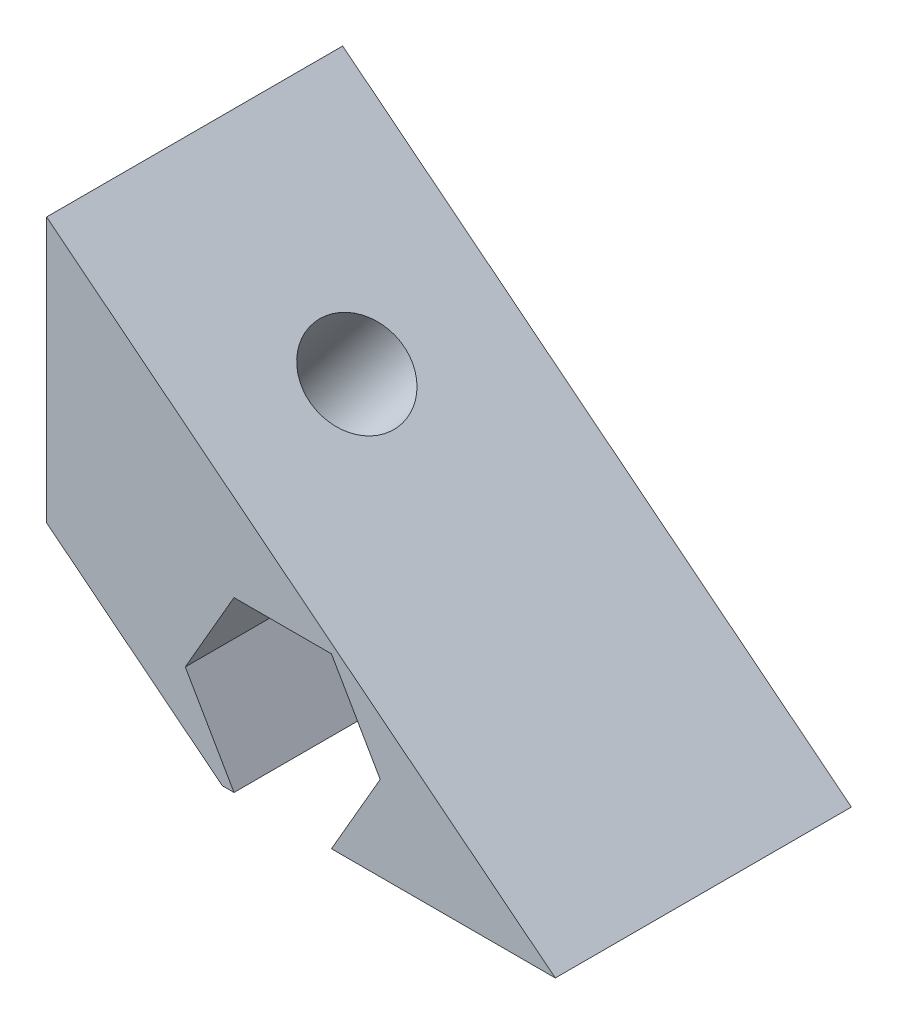
ISO-10303-21;
HEADER;
FILE_DESCRIPTION(('STEP AP214'),'2;1');
FILE_NAME('part.step','',(''),(''),'','','');
FILE_SCHEMA(('AUTOMOTIVE_DESIGN { 1 0 10303 214 1 1 1 1 }'));
ENDSEC;
DATA;
#1=APPLICATION_CONTEXT('core data for automotive mechanical design processes');
#2=APPLICATION_PROTOCOL_DEFINITION('international standard','automotive_design',2000,#1);
#3=PRODUCT_CONTEXT('',#1,'mechanical');
#4=PRODUCT('Part','Part','',(#3));
#5=PRODUCT_RELATED_PRODUCT_CATEGORY('part','',(#4));
#6=PRODUCT_DEFINITION_FORMATION('','',#4);
#7=PRODUCT_DEFINITION_CONTEXT('part definition',#1,'design');
#8=PRODUCT_DEFINITION('design','',#6,#7);
#9=PRODUCT_DEFINITION_SHAPE('','',#8);
#10=(LENGTH_UNIT() NAMED_UNIT(*) SI_UNIT(.MILLI.,.METRE.));
#11=(NAMED_UNIT(*) PLANE_ANGLE_UNIT() SI_UNIT($,.RADIAN.));
#12=(NAMED_UNIT(*) SI_UNIT($,.STERADIAN.) SOLID_ANGLE_UNIT());
#13=UNCERTAINTY_MEASURE_WITH_UNIT(LENGTH_MEASURE(1.E-05),#10,'distance_accuracy_value','');
#14=(GEOMETRIC_REPRESENTATION_CONTEXT(3) GLOBAL_UNCERTAINTY_ASSIGNED_CONTEXT((#13)) GLOBAL_UNIT_ASSIGNED_CONTEXT((#10,
#11,#12)) REPRESENTATION_CONTEXT('',''));
#15=CARTESIAN_POINT('',(0.,0.,0.));
#16=DIRECTION('',(0.,0.,1.));
#17=DIRECTION('',(1.,0.,0.));
#18=AXIS2_PLACEMENT_3D('',#15,#16,#17);
#19=CARTESIAN_POINT('',(-1.18087962656431,0.937540612039793,5.));
#20=DIRECTION('',(0.622523565821539,0.782601054175649,0.));
#21=DIRECTION('',(-0.782601054175649,0.622523565821539,0.));
#22=AXIS2_PLACEMENT_3D('',#19,#20,#21);
#23=CYLINDRICAL_SURFACE('',#22,1.6);
#24=CARTESIAN_POINT('',(5.47820737922954,9.30896427646635,5.));
#25=DIRECTION('',(0.622523565821539,0.782601054175649,0.));
#26=DIRECTION('',(-0.782601054175649,0.622523565821539,0.));
#27=AXIS2_PLACEMENT_3D('',#24,#25,#26);
#28=CIRCLE('',#27,1.6);
#29=CARTESIAN_POINT('',(4.2260456925485,10.3050019817808,5.));
#30=VERTEX_POINT('',#29);
#31=EDGE_CURVE('E209',#30,#30,#28,.T.);
#32=ORIENTED_EDGE('',*,*,#31,.T.);
#33=EDGE_LOOP('',(#32));
#34=FACE_BOUND('',#33,.T.);
#35=CARTESIAN_POINT('',(2.67685133303261,5.78725953267592,5.));
#36=DIRECTION('',(-0.622523565821539,-0.782601054175649,0.));
#37=DIRECTION('',(0.782601054175649,-0.622523565821539,0.));
#38=AXIS2_PLACEMENT_3D('',#35,#36,#37);
#39=CIRCLE('',#38,1.6);
#40=CARTESIAN_POINT('',(3.92901301971365,4.79122182736146,5.));
#41=VERTEX_POINT('',#40);
#42=EDGE_CURVE('E201',#41,#41,#39,.F.);
#43=ORIENTED_EDGE('',*,*,#42,.F.);
#44=EDGE_LOOP('',(#43));
#45=FACE_BOUND('',#44,.T.);
#46=ADVANCED_FACE('F32',(#34,#45),#23,.F.);
#47=CARTESIAN_POINT('',(7.97577106518184,2.85,10.));
#48=DIRECTION('',(0.,0.,-1.));
#49=DIRECTION('',(-1.,0.,0.));
#50=AXIS2_PLACEMENT_3D('',#47,#48,#49);
#51=CYLINDRICAL_SURFACE('',#50,1.6);
#52=CARTESIAN_POINT('',(7.97577106518184,2.85,0.));
#53=DIRECTION('',(0.,0.,1.));
#54=DIRECTION('',(1.,0.,0.));
#55=AXIS2_PLACEMENT_3D('',#52,#53,#54);
#56=CIRCLE('',#55,1.6);
#57=CARTESIAN_POINT('',(9.57577106518184,2.85,0.));
#58=VERTEX_POINT('',#57);
#59=EDGE_CURVE('E253',#58,#58,#56,.T.);
#60=ORIENTED_EDGE('',*,*,#59,.F.);
#61=EDGE_LOOP('',(#60));
#62=FACE_BOUND('',#61,.T.);
#63=CARTESIAN_POINT('',(7.97577106518184,2.85,4.5));
#64=DIRECTION('',(0.,0.,1.));
#65=DIRECTION('',(1.,0.,0.));
#66=AXIS2_PLACEMENT_3D('',#63,#64,#65);
#67=CIRCLE('',#66,1.6);
#68=CARTESIAN_POINT('',(9.57577106518184,2.85,4.5));
#69=VERTEX_POINT('',#68);
#70=EDGE_CURVE('E252',#69,#69,#67,.T.);
#71=ORIENTED_EDGE('',*,*,#70,.T.);
#72=EDGE_LOOP('',(#71));
#73=FACE_BOUND('',#72,.T.);
#74=ADVANCED_FACE('F379',(#62,#73),#51,.F.);
#75=CARTESIAN_POINT('',(0.,13.6666292372171,10.));
#76=DIRECTION('',(0.,0.,1.));
#77=DIRECTION('',(1.,0.,0.));
#78=AXIS2_PLACEMENT_3D('',#75,#76,#77);
#79=PLANE('',#78);
#80=DIRECTION('',(0.500000000000001,-0.866025403784438,0.));
#81=VECTOR('',#80,1.);
#82=CARTESIAN_POINT('',(4.68487453080097,2.85,10.));
#83=LINE('',#82,#81);
#84=CARTESIAN_POINT('',(4.68487453080097,2.85,10.));
#85=VERTEX_POINT('',#84);
#86=CARTESIAN_POINT('',(6.33032279799141,0.,10.));
#87=VERTEX_POINT('',#86);
#88=EDGE_CURVE('E212',#85,#87,#83,.T.);
#89=ORIENTED_EDGE('',*,*,#88,.F.);
#90=DIRECTION('',(-0.5,-0.866025403784438,0.));
#91=VECTOR('',#90,1.);
#92=CARTESIAN_POINT('',(6.33032279799141,5.7,10.));
#93=LINE('',#92,#91);
#94=CARTESIAN_POINT('',(6.33032279799141,5.7,10.));
#95=VERTEX_POINT('',#94);
#96=EDGE_CURVE('E235',#95,#85,#93,.T.);
#97=ORIENTED_EDGE('',*,*,#96,.F.);
#98=DIRECTION('',(-1.,0.,0.));
#99=VECTOR('',#98,1.);
#100=CARTESIAN_POINT('',(9.62121933237227,5.7,10.));
#101=LINE('',#100,#99);
#102=CARTESIAN_POINT('',(9.62121933237227,5.7,10.));
#103=VERTEX_POINT('',#102);
#104=EDGE_CURVE('E232',#103,#95,#101,.T.);
#105=ORIENTED_EDGE('',*,*,#104,.F.);
#106=DIRECTION('',(-0.5,0.866025403784439,0.));
#107=VECTOR('',#106,1.);
#108=CARTESIAN_POINT('',(11.2666675995627,2.85,10.));
#109=LINE('',#108,#107);
#110=CARTESIAN_POINT('',(11.2666675995627,2.85,10.));
#111=VERTEX_POINT('',#110);
#112=EDGE_CURVE('E229',#111,#103,#109,.T.);
#113=ORIENTED_EDGE('',*,*,#112,.F.);
#114=DIRECTION('',(0.5,0.866025403784439,0.));
#115=VECTOR('',#114,1.);
#116=CARTESIAN_POINT('',(9.62121933237227,0.,10.));
#117=LINE('',#116,#115);
#118=CARTESIAN_POINT('',(9.62121933237227,0.,10.));
#119=VERTEX_POINT('',#118);
#120=EDGE_CURVE('E226',#119,#111,#117,.T.);
#121=ORIENTED_EDGE('',*,*,#120,.F.);
#122=DIRECTION('',(1.,0.,0.));
#123=VECTOR('',#122,1.);
#124=CARTESIAN_POINT('',(17.1809053267872,0.,10.));
#125=LINE('',#124,#123);
#126=CARTESIAN_POINT('',(17.1809053267872,0.,10.));
#127=VERTEX_POINT('',#126);
#128=EDGE_CURVE('E265',#119,#127,#125,.T.);
#129=ORIENTED_EDGE('',*,*,#128,.T.);
#130=DIRECTION('',(-0.782601054175649,0.622523565821539,0.));
#131=VECTOR('',#130,1.);
#132=CARTESIAN_POINT('',(0.,13.6666292372171,10.));
#133=LINE('',#132,#131);
#134=CARTESIAN_POINT('',(0.,13.6666292372171,10.));
#135=VERTEX_POINT('',#134);
#136=EDGE_CURVE('E257',#127,#135,#133,.T.);
#137=ORIENTED_EDGE('',*,*,#136,.T.);
#138=DIRECTION('',(0.,-1.,0.));
#139=VECTOR('',#138,1.);
#140=CARTESIAN_POINT('',(0.,4.72209745739037,10.));
#141=LINE('',#140,#139);
#142=CARTESIAN_POINT('',(0.,4.72209745739037,10.));
#143=VERTEX_POINT('',#142);
#144=EDGE_CURVE('E260',#135,#143,#141,.T.);
#145=ORIENTED_EDGE('',*,*,#144,.T.);
#146=DIRECTION('',(0.782601054175649,-0.622523565821538,0.));
#147=VECTOR('',#146,1.);
#148=CARTESIAN_POINT('',(5.93635108929075,0.,10.));
#149=LINE('',#148,#147);
#150=CARTESIAN_POINT('',(5.93635108929075,0.,10.));
#151=VERTEX_POINT('',#150);
#152=EDGE_CURVE('E263',#143,#151,#149,.T.);
#153=ORIENTED_EDGE('',*,*,#152,.T.);
#154=EDGE_CURVE('E266',#151,#87,#125,.T.);
#155=ORIENTED_EDGE('',*,*,#154,.T.);
#156=EDGE_LOOP('',(#89,#97,#105,#113,#121,#129,#137,#145,#153,#155));
#157=FACE_BOUND('',#156,.T.);
#158=ADVANCED_FACE('F338',(#157),#79,.T.);
#159=CARTESIAN_POINT('',(0.,13.6666292372171,0.));
#160=DIRECTION('',(0.,0.,1.));
#161=DIRECTION('',(1.,0.,0.));
#162=AXIS2_PLACEMENT_3D('',#159,#160,#161);
#163=PLANE('',#162);
#164=DIRECTION('',(-0.782601054175649,0.622523565821539,0.));
#165=VECTOR('',#164,1.);
#166=CARTESIAN_POINT('',(0.,13.6666292372171,0.));
#167=LINE('',#166,#165);
#168=CARTESIAN_POINT('',(17.1809053267872,0.,0.));
#169=VERTEX_POINT('',#168);
#170=CARTESIAN_POINT('',(0.,13.6666292372171,0.));
#171=VERTEX_POINT('',#170);
#172=EDGE_CURVE('E256',#169,#171,#167,.T.);
#173=ORIENTED_EDGE('',*,*,#172,.F.);
#174=DIRECTION('',(1.,0.,0.));
#175=VECTOR('',#174,1.);
#176=CARTESIAN_POINT('',(17.1809053267872,0.,0.));
#177=LINE('',#176,#175);
#178=CARTESIAN_POINT('',(5.93635108929075,0.,0.));
#179=VERTEX_POINT('',#178);
#180=EDGE_CURVE('E261',#179,#169,#177,.T.);
#181=ORIENTED_EDGE('',*,*,#180,.F.);
#182=DIRECTION('',(0.782601054175649,-0.622523565821538,0.));
#183=VECTOR('',#182,1.);
#184=CARTESIAN_POINT('',(5.93635108929075,0.,0.));
#185=LINE('',#184,#183);
#186=CARTESIAN_POINT('',(0.,4.72209745739037,0.));
#187=VERTEX_POINT('',#186);
#188=EDGE_CURVE('E275',#187,#179,#185,.T.);
#189=ORIENTED_EDGE('',*,*,#188,.F.);
#190=DIRECTION('',(0.,-1.,0.));
#191=VECTOR('',#190,1.);
#192=CARTESIAN_POINT('',(0.,4.72209745739037,0.));
#193=LINE('',#192,#191);
#194=EDGE_CURVE('E272',#171,#187,#193,.T.);
#195=ORIENTED_EDGE('',*,*,#194,.F.);
#196=EDGE_LOOP('',(#173,#181,#189,#195));
#197=FACE_BOUND('',#196,.T.);
#198=ORIENTED_EDGE('',*,*,#59,.T.);
#199=EDGE_LOOP('',(#198));
#200=FACE_BOUND('',#199,.T.);
#201=ADVANCED_FACE('F329',(#197,#200),#163,.F.);
#202=CARTESIAN_POINT('',(0.,13.6666292372171,10.));
#203=DIRECTION('',(-0.622523565821539,-0.782601054175649,0.));
#204=DIRECTION('',(0.782601054175649,-0.622523565821539,0.));
#205=AXIS2_PLACEMENT_3D('',#202,#203,#204);
#206=PLANE('',#205);
#207=ORIENTED_EDGE('',*,*,#31,.F.);
#208=EDGE_LOOP('',(#207));
#209=FACE_BOUND('',#208,.T.);
#210=ORIENTED_EDGE('',*,*,#172,.T.);
#211=DIRECTION('',(0.,0.,-1.));
#212=VECTOR('',#211,1.);
#213=CARTESIAN_POINT('',(0.,13.6666292372171,10.));
#214=LINE('',#213,#212);
#215=EDGE_CURVE('E285',#135,#171,#214,.T.);
#216=ORIENTED_EDGE('',*,*,#215,.F.);
#217=ORIENTED_EDGE('',*,*,#136,.F.);
#218=DIRECTION('',(0.,0.,-1.));
#219=VECTOR('',#218,1.);
#220=CARTESIAN_POINT('',(17.1809053267872,0.,10.));
#221=LINE('',#220,#219);
#222=EDGE_CURVE('E269',#127,#169,#221,.T.);
#223=ORIENTED_EDGE('',*,*,#222,.T.);
#224=EDGE_LOOP('',(#210,#216,#217,#223));
#225=FACE_BOUND('',#224,.T.);
#226=ADVANCED_FACE('F34',(#209,#225),#206,.F.);
#227=CARTESIAN_POINT('',(0.,4.72209745739037,10.));
#228=DIRECTION('',(1.,0.,0.));
#229=DIRECTION('',(0.,1.,0.));
#230=AXIS2_PLACEMENT_3D('',#227,#228,#229);
#231=PLANE('',#230);
#232=DIRECTION('',(0.,0.,-1.));
#233=VECTOR('',#232,1.);
#234=CARTESIAN_POINT('',(0.,4.72209745739037,10.));
#235=LINE('',#234,#233);
#236=CARTESIAN_POINT('',(0.,4.72209745739037,2.15));
#237=VERTEX_POINT('',#236);
#238=EDGE_CURVE('E283',#237,#187,#235,.T.);
#239=ORIENTED_EDGE('',*,*,#238,.F.);
#240=DIRECTION('',(0.,1.,0.));
#241=VECTOR('',#240,1.);
#242=CARTESIAN_POINT('',(0.,4.72209745739037,2.15));
#243=LINE('',#242,#241);
#244=CARTESIAN_POINT('',(0.,5.06526532620885,2.15));
#245=VERTEX_POINT('',#244);
#246=EDGE_CURVE('E206',#237,#245,#243,.T.);
#247=ORIENTED_EDGE('',*,*,#246,.T.);
#248=DIRECTION('',(0.,0.680003614075,0.733208759389124));
#249=VECTOR('',#248,1.);
#250=CARTESIAN_POINT('',(0.,8.8204719760539,6.19902319927818));
#251=LINE('',#250,#249);
#252=CARTESIAN_POINT('',(0.,7.70845565269705,5.));
#253=VERTEX_POINT('',#252);
#254=EDGE_CURVE('E12',#245,#253,#251,.T.);
#255=ORIENTED_EDGE('',*,*,#254,.T.);
#256=DIRECTION('',(0.,-0.680003614074999,0.733208759389125));
#257=VECTOR('',#256,1.);
#258=CARTESIAN_POINT('',(0.,3.83462591349338,9.17692764917121));
#259=LINE('',#258,#257);
#260=CARTESIAN_POINT('',(0.,5.06526532620885,7.85));
#261=VERTEX_POINT('',#260);
#262=EDGE_CURVE('E40',#253,#261,#259,.T.);
#263=ORIENTED_EDGE('',*,*,#262,.T.);
#264=DIRECTION('',(0.,-1.,0.));
#265=VECTOR('',#264,1.);
#266=CARTESIAN_POINT('',(0.,4.72209745739037,7.85));
#267=LINE('',#266,#265);
#268=CARTESIAN_POINT('',(0.,4.72209745739037,7.85));
#269=VERTEX_POINT('',#268);
#270=EDGE_CURVE('E204',#261,#269,#267,.T.);
#271=ORIENTED_EDGE('',*,*,#270,.T.);
#272=EDGE_CURVE('E182',#143,#269,#235,.T.);
#273=ORIENTED_EDGE('',*,*,#272,.F.);
#274=ORIENTED_EDGE('',*,*,#144,.F.);
#275=ORIENTED_EDGE('',*,*,#215,.T.);
#276=ORIENTED_EDGE('',*,*,#194,.T.);
#277=EDGE_LOOP('',(#239,#247,#255,#263,#271,#273,#274,#275,#276));
#278=FACE_BOUND('',#277,.T.);
#279=ADVANCED_FACE('F300',(#278),#231,.F.);
#280=CARTESIAN_POINT('',(5.93635108929075,0.,10.));
#281=DIRECTION('',(0.622523565821538,0.782601054175649,0.));
#282=DIRECTION('',(-0.782601054175649,0.622523565821538,0.));
#283=AXIS2_PLACEMENT_3D('',#280,#281,#282);
#284=PLANE('',#283);
#285=DIRECTION('',(0.391300527087824,-0.311261782910769,0.866025403784439));
#286=VECTOR('',#285,1.);
#287=CARTESIAN_POINT('',(2.40827196697349,2.80642657457054,2.15));
#288=LINE('',#287,#286);
#289=CARTESIAN_POINT('',(2.40827196697349,2.80642657457054,2.15));
#290=VERTEX_POINT('',#289);
#291=CARTESIAN_POINT('',(3.69600151546822,1.78209625190428,5.));
#292=VERTEX_POINT('',#291);
#293=EDGE_CURVE('E47',#290,#292,#288,.T.);
#294=ORIENTED_EDGE('',*,*,#293,.F.);
#295=DIRECTION('',(0.782601054175649,-0.622523565821539,0.));
#296=VECTOR('',#295,1.);
#297=CARTESIAN_POINT('',(-0.167187130015962,4.85508721990307,2.15));
#298=LINE('',#297,#296);
#299=EDGE_CURVE('E183',#237,#290,#298,.T.);
#300=ORIENTED_EDGE('',*,*,#299,.F.);
#301=ORIENTED_EDGE('',*,*,#238,.T.);
#302=ORIENTED_EDGE('',*,*,#188,.T.);
#303=DIRECTION('',(0.,0.,-1.));
#304=VECTOR('',#303,1.);
#305=CARTESIAN_POINT('',(5.93635108929075,0.,10.));
#306=LINE('',#305,#304);
#307=EDGE_CURVE('E280',#151,#179,#306,.T.);
#308=ORIENTED_EDGE('',*,*,#307,.F.);
#309=ORIENTED_EDGE('',*,*,#152,.F.);
#310=ORIENTED_EDGE('',*,*,#272,.T.);
#311=DIRECTION('',(-0.782601054175649,0.622523565821539,0.));
#312=VECTOR('',#311,1.);
#313=CARTESIAN_POINT('',(2.40827196697349,2.80642657457055,7.85));
#314=LINE('',#313,#312);
#315=CARTESIAN_POINT('',(2.40827196697349,2.80642657457055,7.85));
#316=VERTEX_POINT('',#315);
#317=EDGE_CURVE('E163',#316,#269,#314,.T.);
#318=ORIENTED_EDGE('',*,*,#317,.F.);
#319=DIRECTION('',(-0.391300527087825,0.311261782910769,0.866025403784438));
#320=VECTOR('',#319,1.);
#321=CARTESIAN_POINT('',(3.69600151546822,1.78209625190428,5.));
#322=LINE('',#321,#320);
#323=EDGE_CURVE('E174',#292,#316,#322,.T.);
#324=ORIENTED_EDGE('',*,*,#323,.F.);
#325=EDGE_LOOP('',(#294,#300,#301,#302,#308,#309,#310,#318,#324));
#326=FACE_BOUND('',#325,.T.);
#327=ADVANCED_FACE('F179',(#326),#284,.F.);
#328=CARTESIAN_POINT('',(17.1809053267872,0.,10.));
#329=DIRECTION('',(0.,1.,0.));
#330=DIRECTION('',(-1.,0.,0.));
#331=AXIS2_PLACEMENT_3D('',#328,#329,#330);
#332=PLANE('',#331);
#333=DIRECTION('',(-1.,0.,0.));
#334=VECTOR('',#333,1.);
#335=CARTESIAN_POINT('',(6.33032279799141,0.,4.5));
#336=LINE('',#335,#334);
#337=CARTESIAN_POINT('',(9.62121933237227,0.,4.5));
#338=VERTEX_POINT('',#337);
#339=CARTESIAN_POINT('',(6.33032279799141,0.,4.5));
#340=VERTEX_POINT('',#339);
#341=EDGE_CURVE('E224',#338,#340,#336,.T.);
#342=ORIENTED_EDGE('',*,*,#341,.T.);
#343=DIRECTION('',(0.,0.,1.));
#344=VECTOR('',#343,1.);
#345=CARTESIAN_POINT('',(6.33032279799141,0.,-8.70689382041609));
#346=LINE('',#345,#344);
#347=EDGE_CURVE('E238',#340,#87,#346,.T.);
#348=ORIENTED_EDGE('',*,*,#347,.T.);
#349=ORIENTED_EDGE('',*,*,#154,.F.);
#350=ORIENTED_EDGE('',*,*,#307,.T.);
#351=ORIENTED_EDGE('',*,*,#180,.T.);
#352=ORIENTED_EDGE('',*,*,#222,.F.);
#353=ORIENTED_EDGE('',*,*,#128,.F.);
#354=DIRECTION('',(0.,0.,1.));
#355=VECTOR('',#354,1.);
#356=CARTESIAN_POINT('',(9.62121933237227,0.,-8.70689382041609));
#357=LINE('',#356,#355);
#358=EDGE_CURVE('E246',#338,#119,#357,.T.);
#359=ORIENTED_EDGE('',*,*,#358,.F.);
#360=EDGE_LOOP('',(#342,#348,#349,#350,#351,#352,#353,#359));
#361=FACE_BOUND('',#360,.T.);
#362=ADVANCED_FACE('F334',(#361),#332,.F.);
#363=CARTESIAN_POINT('',(4.68487453080097,2.85,-8.70689382041609));
#364=DIRECTION('',(-0.866025403784438,-0.500000000000001,0.));
#365=DIRECTION('',(0.500000000000001,-0.866025403784438,0.));
#366=AXIS2_PLACEMENT_3D('',#363,#364,#365);
#367=PLANE('',#366);
#368=DIRECTION('',(-0.500000000000001,0.866025403784438,0.));
#369=VECTOR('',#368,1.);
#370=CARTESIAN_POINT('',(4.68487453080097,2.85,4.5));
#371=LINE('',#370,#369);
#372=CARTESIAN_POINT('',(4.68487453080097,2.85,4.5));
#373=VERTEX_POINT('',#372);
#374=EDGE_CURVE('E222',#340,#373,#371,.T.);
#375=ORIENTED_EDGE('',*,*,#374,.T.);
#376=DIRECTION('',(0.,0.,1.));
#377=VECTOR('',#376,1.);
#378=CARTESIAN_POINT('',(4.68487453080097,2.85,-8.70689382041609));
#379=LINE('',#378,#377);
#380=EDGE_CURVE('E216',#373,#85,#379,.T.);
#381=ORIENTED_EDGE('',*,*,#380,.T.);
#382=ORIENTED_EDGE('',*,*,#88,.T.);
#383=ORIENTED_EDGE('',*,*,#347,.F.);
#384=EDGE_LOOP('',(#375,#381,#382,#383));
#385=FACE_BOUND('',#384,.T.);
#386=ADVANCED_FACE('F363',(#385),#367,.F.);
#387=CARTESIAN_POINT('',(6.33032279799141,5.7,-8.70689382041609));
#388=DIRECTION('',(-0.866025403784438,0.5,0.));
#389=DIRECTION('',(-0.5,-0.866025403784438,0.));
#390=AXIS2_PLACEMENT_3D('',#387,#388,#389);
#391=PLANE('',#390);
#392=DIRECTION('',(0.,0.,1.));
#393=VECTOR('',#392,1.);
#394=CARTESIAN_POINT('',(5.21502903711291,3.76825454079387,-8.70689382041609));
#395=LINE('',#394,#393);
#396=CARTESIAN_POINT('',(5.21502903711291,3.76825454079387,4.91748890913058));
#397=VERTEX_POINT('',#396);
#398=CARTESIAN_POINT('',(5.21502903711291,3.76825454079387,5.08251109086943));
#399=VERTEX_POINT('',#398);
#400=EDGE_CURVE('E202',#397,#399,#395,.T.);
#401=ORIENTED_EDGE('',*,*,#400,.F.);
#402=DIRECTION('',(-0.484375872290359,-0.838963620767395,0.248032371620754));
#403=VECTOR('',#402,1.);
#404=CARTESIAN_POINT('',(7.89855541531584,8.41625857129264,3.54334653340644));
#405=LINE('',#404,#403);
#406=CARTESIAN_POINT('',(5.05389530544575,3.48916273073317,5.));
#407=VERTEX_POINT('',#406);
#408=EDGE_CURVE('E295',#397,#407,#405,.T.);
#409=ORIENTED_EDGE('',*,*,#408,.T.);
#410=DIRECTION('',(0.484375872290359,0.838963620767395,0.248032371620754));
#411=VECTOR('',#410,1.);
#412=CARTESIAN_POINT('',(4.60503839552223,2.71171975741727,4.7701556781508));
#413=LINE('',#412,#411);
#414=EDGE_CURVE('E288',#407,#399,#413,.T.);
#415=ORIENTED_EDGE('',*,*,#414,.T.);
#416=EDGE_LOOP('',(#401,#409,#415));
#417=FACE_BOUND('',#416,.T.);
#418=DIRECTION('',(0.5,0.866025403784439,0.));
#419=VECTOR('',#418,1.);
#420=CARTESIAN_POINT('',(6.33032279799141,5.7,4.5));
#421=LINE('',#420,#419);
#422=CARTESIAN_POINT('',(6.33032279799141,5.7,4.5));
#423=VERTEX_POINT('',#422);
#424=EDGE_CURVE('E220',#373,#423,#421,.T.);
#425=ORIENTED_EDGE('',*,*,#424,.T.);
#426=DIRECTION('',(0.,0.,1.));
#427=VECTOR('',#426,1.);
#428=CARTESIAN_POINT('',(6.33032279799141,5.7,-8.70689382041609));
#429=LINE('',#428,#427);
#430=EDGE_CURVE('E240',#423,#95,#429,.T.);
#431=ORIENTED_EDGE('',*,*,#430,.T.);
#432=ORIENTED_EDGE('',*,*,#96,.T.);
#433=ORIENTED_EDGE('',*,*,#380,.F.);
#434=EDGE_LOOP('',(#425,#431,#432,#433));
#435=FACE_BOUND('',#434,.T.);
#436=ADVANCED_FACE('F365',(#417,#435),#391,.F.);
#437=CARTESIAN_POINT('',(9.62121933237227,5.7,-8.70689382041609));
#438=DIRECTION('',(0.,1.,0.));
#439=DIRECTION('',(0.,0.,1.));
#440=AXIS2_PLACEMENT_3D('',#437,#438,#439);
#441=PLANE('',#440);
#442=DIRECTION('',(1.,0.,0.));
#443=VECTOR('',#442,1.);
#444=CARTESIAN_POINT('',(9.62121933237227,5.7,4.5));
#445=LINE('',#444,#443);
#446=CARTESIAN_POINT('',(9.62121933237227,5.7,4.5));
#447=VERTEX_POINT('',#446);
#448=EDGE_CURVE('E218',#423,#447,#445,.T.);
#449=ORIENTED_EDGE('',*,*,#448,.T.);
#450=DIRECTION('',(0.,0.,1.));
#451=VECTOR('',#450,1.);
#452=CARTESIAN_POINT('',(9.62121933237227,5.7,-8.70689382041609));
#453=LINE('',#452,#451);
#454=EDGE_CURVE('E242',#447,#103,#453,.T.);
#455=ORIENTED_EDGE('',*,*,#454,.T.);
#456=ORIENTED_EDGE('',*,*,#104,.T.);
#457=ORIENTED_EDGE('',*,*,#430,.F.);
#458=EDGE_LOOP('',(#449,#455,#456,#457));
#459=FACE_BOUND('',#458,.T.);
#460=ADVANCED_FACE('F368',(#459),#441,.F.);
#461=CARTESIAN_POINT('',(11.2666675995627,2.85,-8.70689382041609));
#462=DIRECTION('',(0.866025403784438,0.5,0.));
#463=DIRECTION('',(-0.5,0.866025403784439,0.));
#464=AXIS2_PLACEMENT_3D('',#461,#462,#463);
#465=PLANE('',#464);
#466=DIRECTION('',(0.5,-0.866025403784439,0.));
#467=VECTOR('',#466,1.);
#468=CARTESIAN_POINT('',(11.2666675995627,2.85,4.5));
#469=LINE('',#468,#467);
#470=CARTESIAN_POINT('',(11.2666675995627,2.85,4.5));
#471=VERTEX_POINT('',#470);
#472=EDGE_CURVE('E215',#447,#471,#469,.T.);
#473=ORIENTED_EDGE('',*,*,#472,.T.);
#474=DIRECTION('',(0.,0.,1.));
#475=VECTOR('',#474,1.);
#476=CARTESIAN_POINT('',(11.2666675995627,2.85,-8.70689382041609));
#477=LINE('',#476,#475);
#478=EDGE_CURVE('E244',#471,#111,#477,.T.);
#479=ORIENTED_EDGE('',*,*,#478,.T.);
#480=ORIENTED_EDGE('',*,*,#112,.T.);
#481=ORIENTED_EDGE('',*,*,#454,.F.);
#482=EDGE_LOOP('',(#473,#479,#480,#481));
#483=FACE_BOUND('',#482,.T.);
#484=ADVANCED_FACE('F354',(#483),#465,.F.);
#485=CARTESIAN_POINT('',(9.62121933237227,0.,-8.70689382041609));
#486=DIRECTION('',(0.866025403784439,-0.5,0.));
#487=DIRECTION('',(0.5,0.866025403784439,0.));
#488=AXIS2_PLACEMENT_3D('',#485,#486,#487);
#489=PLANE('',#488);
#490=DIRECTION('',(-0.5,-0.866025403784439,0.));
#491=VECTOR('',#490,1.);
#492=CARTESIAN_POINT('',(9.62121933237227,0.,4.5));
#493=LINE('',#492,#491);
#494=EDGE_CURVE('E213',#471,#338,#493,.T.);
#495=ORIENTED_EDGE('',*,*,#494,.T.);
#496=ORIENTED_EDGE('',*,*,#358,.T.);
#497=ORIENTED_EDGE('',*,*,#120,.T.);
#498=ORIENTED_EDGE('',*,*,#478,.F.);
#499=EDGE_LOOP('',(#495,#496,#497,#498));
#500=FACE_BOUND('',#499,.T.);
#501=ADVANCED_FACE('F347',(#500),#489,.F.);
#502=CARTESIAN_POINT('',(0.,13.6666292372171,4.5));
#503=DIRECTION('',(0.,0.,1.));
#504=DIRECTION('',(1.,0.,0.));
#505=AXIS2_PLACEMENT_3D('',#502,#503,#504);
#506=PLANE('',#505);
#507=ORIENTED_EDGE('',*,*,#70,.F.);
#508=EDGE_LOOP('',(#507));
#509=FACE_BOUND('',#508,.T.);
#510=ORIENTED_EDGE('',*,*,#374,.F.);
#511=ORIENTED_EDGE('',*,*,#341,.F.);
#512=ORIENTED_EDGE('',*,*,#494,.F.);
#513=ORIENTED_EDGE('',*,*,#472,.F.);
#514=ORIENTED_EDGE('',*,*,#448,.F.);
#515=ORIENTED_EDGE('',*,*,#424,.F.);
#516=EDGE_LOOP('',(#510,#511,#512,#513,#514,#515));
#517=FACE_BOUND('',#516,.T.);
#518=ADVANCED_FACE('F359',(#509,#517),#506,.T.);
#519=CARTESIAN_POINT('',(8.32299487055503,18.1716492042519,5.));
#520=DIRECTION('',(-0.677752393944594,0.539121222455927,-0.5));
#521=DIRECTION('',(-0.622523565821539,-0.782601054175649,0.));
#522=AXIS2_PLACEMENT_3D('',#519,#520,#521);
#523=PLANE('',#522);
#524=DIRECTION('',(-0.622523565821539,-0.782601054175649,0.));
#525=VECTOR('',#524,1.);
#526=CARTESIAN_POINT('',(9.61072441904975,17.1473188815857,2.15));
#527=LINE('',#526,#525);
#528=CARTESIAN_POINT('',(1.38912178453789,6.81158985534219,2.15));
#529=VERTEX_POINT('',#528);
#530=EDGE_CURVE('E190',#529,#245,#527,.T.);
#531=ORIENTED_EDGE('',*,*,#530,.F.);
#532=DIRECTION('',(-0.391300527087824,0.311261782910769,0.866025403784439));
#533=VECTOR('',#532,1.);
#534=CARTESIAN_POINT('',(0.101392236043158,7.83592017800845,5.));
#535=LINE('',#534,#533);
#536=CARTESIAN_POINT('',(0.101392236043159,7.83592017800845,5.));
#537=VERTEX_POINT('',#536);
#538=EDGE_CURVE('E308',#529,#537,#535,.T.);
#539=ORIENTED_EDGE('',*,*,#538,.T.);
#540=DIRECTION('',(-0.622523565821539,-0.782601054175649,0.));
#541=VECTOR('',#540,1.);
#542=CARTESIAN_POINT('',(8.32299487055503,18.1716492042519,5.));
#543=LINE('',#542,#541);
#544=EDGE_CURVE('E193',#537,#253,#543,.T.);
#545=ORIENTED_EDGE('',*,*,#544,.T.);
#546=ORIENTED_EDGE('',*,*,#254,.F.);
#547=EDGE_LOOP('',(#531,#539,#545,#546));
#548=FACE_BOUND('',#547,.T.);
#549=ADVANCED_FACE('F306',(#548),#523,.F.);
#550=CARTESIAN_POINT('',(9.61072441904976,17.1473188815857,7.85));
#551=DIRECTION('',(-0.677752393944594,0.539121222455927,0.499999999999999));
#552=DIRECTION('',(-0.622523565821539,-0.782601054175649,0.));
#553=AXIS2_PLACEMENT_3D('',#550,#551,#552);
#554=PLANE('',#553);
#555=ORIENTED_EDGE('',*,*,#544,.F.);
#556=DIRECTION('',(0.391300527087824,-0.311261782910769,0.866025403784439));
#557=VECTOR('',#556,1.);
#558=CARTESIAN_POINT('',(1.38912178453788,6.81158985534219,7.85));
#559=LINE('',#558,#557);
#560=CARTESIAN_POINT('',(1.38912178453789,6.81158985534219,7.85));
#561=VERTEX_POINT('',#560);
#562=EDGE_CURVE('E311',#537,#561,#559,.T.);
#563=ORIENTED_EDGE('',*,*,#562,.T.);
#564=DIRECTION('',(-0.622523565821539,-0.782601054175649,0.));
#565=VECTOR('',#564,1.);
#566=CARTESIAN_POINT('',(9.61072441904976,17.1473188815857,7.85));
#567=LINE('',#566,#565);
#568=EDGE_CURVE('E170',#561,#261,#567,.T.);
#569=ORIENTED_EDGE('',*,*,#568,.T.);
#570=ORIENTED_EDGE('',*,*,#262,.F.);
#571=EDGE_LOOP('',(#555,#563,#569,#570));
#572=FACE_BOUND('',#571,.T.);
#573=ADVANCED_FACE('F303',(#572),#554,.F.);
#574=CARTESIAN_POINT('',(9.61072441904975,17.1473188815857,2.15));
#575=DIRECTION('',(0.,0.,-1.));
#576=DIRECTION('',(-1.,0.,0.));
#577=AXIS2_PLACEMENT_3D('',#574,#575,#576);
#578=PLANE('',#577);
#579=ORIENTED_EDGE('',*,*,#299,.T.);
#580=DIRECTION('',(-0.622523565821539,-0.782601054175649,0.));
#581=VECTOR('',#580,1.);
#582=CARTESIAN_POINT('',(12.1861835160392,15.0986582362532,2.15));
#583=LINE('',#582,#581);
#584=CARTESIAN_POINT('',(3.96458088152734,4.76292921000967,2.15));
#585=VERTEX_POINT('',#584);
#586=EDGE_CURVE('E188',#585,#290,#583,.T.);
#587=ORIENTED_EDGE('',*,*,#586,.F.);
#588=DIRECTION('',(-0.782601054175649,0.622523565821539,0.));
#589=VECTOR('',#588,1.);
#590=CARTESIAN_POINT('',(1.38912178453788,6.81158985534219,2.15));
#591=LINE('',#590,#589);
#592=EDGE_CURVE('E310',#585,#529,#591,.T.);
#593=ORIENTED_EDGE('',*,*,#592,.T.);
#594=ORIENTED_EDGE('',*,*,#530,.T.);
#595=ORIENTED_EDGE('',*,*,#246,.F.);
#596=EDGE_LOOP('',(#579,#587,#593,#594,#595));
#597=FACE_BOUND('',#596,.T.);
#598=ADVANCED_FACE('F322',(#597),#578,.F.);
#599=CARTESIAN_POINT('',(12.1861835160392,15.0986582362532,7.85));
#600=DIRECTION('',(0.,0.,1.));
#601=DIRECTION('',(1.,0.,0.));
#602=AXIS2_PLACEMENT_3D('',#599,#600,#601);
#603=PLANE('',#602);
#604=ORIENTED_EDGE('',*,*,#568,.F.);
#605=DIRECTION('',(0.782601054175649,-0.622523565821539,0.));
#606=VECTOR('',#605,1.);
#607=CARTESIAN_POINT('',(3.96458088152734,4.76292921000967,7.85));
#608=LINE('',#607,#606);
#609=CARTESIAN_POINT('',(3.96458088152734,4.76292921000966,7.85));
#610=VERTEX_POINT('',#609);
#611=EDGE_CURVE('E166',#561,#610,#608,.T.);
#612=ORIENTED_EDGE('',*,*,#611,.T.);
#613=DIRECTION('',(-0.622523565821539,-0.782601054175649,0.));
#614=VECTOR('',#613,1.);
#615=CARTESIAN_POINT('',(12.1861835160392,15.0986582362532,7.85));
#616=LINE('',#615,#614);
#617=EDGE_CURVE('E158',#610,#316,#616,.T.);
#618=ORIENTED_EDGE('',*,*,#617,.T.);
#619=ORIENTED_EDGE('',*,*,#317,.T.);
#620=ORIENTED_EDGE('',*,*,#270,.F.);
#621=EDGE_LOOP('',(#604,#612,#618,#619,#620));
#622=FACE_BOUND('',#621,.T.);
#623=ADVANCED_FACE('F161',(#622),#603,.F.);
#624=CARTESIAN_POINT('',(12.1861835160392,15.0986582362532,2.15));
#625=DIRECTION('',(0.677752393944594,-0.539121222455927,-0.5));
#626=DIRECTION('',(0.622523565821539,0.782601054175649,0.));
#627=AXIS2_PLACEMENT_3D('',#624,#625,#626);
#628=PLANE('',#627);
#629=DIRECTION('',(-0.391300527087824,0.311261782910769,-0.866025403784439));
#630=VECTOR('',#629,1.);
#631=CARTESIAN_POINT('',(3.96458088152734,4.76292921000967,2.15));
#632=LINE('',#631,#630);
#633=EDGE_CURVE('E55',#397,#585,#632,.T.);
#634=ORIENTED_EDGE('',*,*,#633,.T.);
#635=ORIENTED_EDGE('',*,*,#586,.T.);
#636=ORIENTED_EDGE('',*,*,#293,.T.);
#637=DIRECTION('',(-0.622523565821539,-0.782601054175649,0.));
#638=VECTOR('',#637,1.);
#639=CARTESIAN_POINT('',(13.4739130645339,14.0743279135869,5.));
#640=LINE('',#639,#638);
#641=EDGE_CURVE('E171',#407,#292,#640,.T.);
#642=ORIENTED_EDGE('',*,*,#641,.F.);
#643=ORIENTED_EDGE('',*,*,#408,.F.);
#644=EDGE_LOOP('',(#634,#635,#636,#642,#643));
#645=FACE_BOUND('',#644,.T.);
#646=ADVANCED_FACE('F318',(#645),#628,.F.);
#647=CARTESIAN_POINT('',(13.4739130645339,14.0743279135869,5.));
#648=DIRECTION('',(0.677752393944593,-0.539121222455926,0.5));
#649=DIRECTION('',(0.622523565821539,0.782601054175649,0.));
#650=AXIS2_PLACEMENT_3D('',#647,#648,#649);
#651=PLANE('',#650);
#652=ORIENTED_EDGE('',*,*,#641,.T.);
#653=ORIENTED_EDGE('',*,*,#323,.T.);
#654=ORIENTED_EDGE('',*,*,#617,.F.);
#655=DIRECTION('',(0.391300527087824,-0.31126178291077,-0.866025403784439));
#656=VECTOR('',#655,1.);
#657=CARTESIAN_POINT('',(5.25231043002206,3.7385988873434,5.));
#658=LINE('',#657,#656);
#659=EDGE_CURVE('E199',#610,#399,#658,.T.);
#660=ORIENTED_EDGE('',*,*,#659,.T.);
#661=ORIENTED_EDGE('',*,*,#414,.F.);
#662=EDGE_LOOP('',(#652,#653,#654,#660,#661));
#663=FACE_BOUND('',#662,.T.);
#664=ADVANCED_FACE('F175',(#663),#651,.F.);
#665=CARTESIAN_POINT('',(-2.80135604619692,10.1449244934267,10.));
#666=DIRECTION('',(-0.622523565821539,-0.782601054175649,0.));
#667=DIRECTION('',(0.782601054175649,-0.622523565821539,0.));
#668=AXIS2_PLACEMENT_3D('',#665,#666,#667);
#669=PLANE('',#668);
#670=ORIENTED_EDGE('',*,*,#42,.T.);
#671=EDGE_LOOP('',(#670));
#672=FACE_BOUND('',#671,.T.);
#673=ORIENTED_EDGE('',*,*,#400,.T.);
#674=ORIENTED_EDGE('',*,*,#659,.F.);
#675=ORIENTED_EDGE('',*,*,#611,.F.);
#676=ORIENTED_EDGE('',*,*,#562,.F.);
#677=ORIENTED_EDGE('',*,*,#538,.F.);
#678=ORIENTED_EDGE('',*,*,#592,.F.);
#679=ORIENTED_EDGE('',*,*,#633,.F.);
#680=EDGE_LOOP('',(#673,#674,#675,#676,#677,#678,#679));
#681=FACE_BOUND('',#680,.T.);
#682=ADVANCED_FACE('F313',(#672,#681),#669,.T.);
#683=CLOSED_SHELL('',(#46,#74,#158,#201,#226,#279,#327,#362,#386,#436,#460,#484,#501,#518,#549,
#573,#598,#623,#646,#664,#682));
#684=MANIFOLD_SOLID_BREP('B2',#683);
#685=ADVANCED_BREP_SHAPE_REPRESENTATION('',(#18,#684),#14);
#686=SHAPE_DEFINITION_REPRESENTATION(#9,#685);
ENDSEC;
END-ISO-10303-21;
